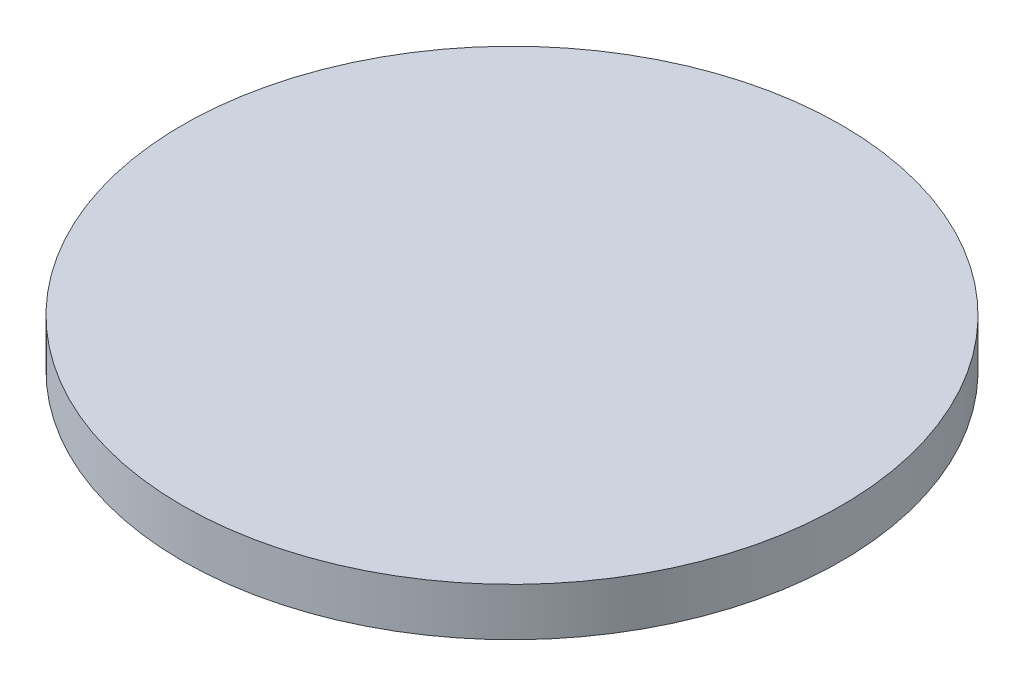
ISO-10303-21;
HEADER;
FILE_DESCRIPTION(('STEP AP214'),'2;1');
FILE_NAME('part.step','',(''),(''),'','','');
FILE_SCHEMA(('AUTOMOTIVE_DESIGN { 1 0 10303 214 1 1 1 1 }'));
ENDSEC;
DATA;
#1=APPLICATION_CONTEXT('core data for automotive mechanical design processes');
#2=APPLICATION_PROTOCOL_DEFINITION('international standard','automotive_design',2000,#1);
#3=PRODUCT_CONTEXT('',#1,'mechanical');
#4=PRODUCT('Part','Part','',(#3));
#5=PRODUCT_RELATED_PRODUCT_CATEGORY('part','',(#4));
#6=PRODUCT_DEFINITION_FORMATION('','',#4);
#7=PRODUCT_DEFINITION_CONTEXT('part definition',#1,'design');
#8=PRODUCT_DEFINITION('design','',#6,#7);
#9=PRODUCT_DEFINITION_SHAPE('','',#8);
#10=(LENGTH_UNIT() NAMED_UNIT(*) SI_UNIT(.MILLI.,.METRE.));
#11=(NAMED_UNIT(*) PLANE_ANGLE_UNIT() SI_UNIT($,.RADIAN.));
#12=(NAMED_UNIT(*) SI_UNIT($,.STERADIAN.) SOLID_ANGLE_UNIT());
#13=UNCERTAINTY_MEASURE_WITH_UNIT(LENGTH_MEASURE(1.E-05),#10,'distance_accuracy_value','');
#14=(GEOMETRIC_REPRESENTATION_CONTEXT(3) GLOBAL_UNCERTAINTY_ASSIGNED_CONTEXT((#13)) GLOBAL_UNIT_ASSIGNED_CONTEXT((#10,
#11,#12)) REPRESENTATION_CONTEXT('',''));
#15=CARTESIAN_POINT('',(0.,0.,0.));
#16=DIRECTION('',(0.,0.,1.));
#17=DIRECTION('',(1.,0.,0.));
#18=AXIS2_PLACEMENT_3D('',#15,#16,#17);
#19=CARTESIAN_POINT('',(91.816549826853,11.938326303827,48.1630816592987));
#20=DIRECTION('',(0.,1.,0.));
#21=DIRECTION('',(0.,0.,1.));
#22=AXIS2_PLACEMENT_3D('',#19,#20,#21);
#23=CYLINDRICAL_SURFACE('',#22,17.4500000000006);
#24=CARTESIAN_POINT('',(91.816549826853,11.938326303827,48.1630816592987));
#25=DIRECTION('',(0.,-1.,0.));
#26=DIRECTION('',(0.,0.,-1.));
#27=AXIS2_PLACEMENT_3D('',#24,#25,#26);
#28=CIRCLE('',#27,17.4500000000006);
#29=CARTESIAN_POINT('',(91.816549826853,11.9383263038271,30.7130816592981));
#30=VERTEX_POINT('',#29);
#31=EDGE_CURVE('E10',#30,#30,#28,.T.);
#32=ORIENTED_EDGE('',*,*,#31,.F.);
#33=EDGE_LOOP('',(#32));
#34=FACE_BOUND('',#33,.T.);
#35=CARTESIAN_POINT('',(91.816549826853,14.478326303827,48.1630816592987));
#36=DIRECTION('',(0.,-1.,0.));
#37=DIRECTION('',(0.,0.,-1.));
#38=AXIS2_PLACEMENT_3D('',#35,#36,#37);
#39=CIRCLE('',#38,17.4500000000006);
#40=CARTESIAN_POINT('',(91.816549826853,14.4783263038271,30.7130816592981));
#41=VERTEX_POINT('',#40);
#42=EDGE_CURVE('E34',#41,#41,#39,.T.);
#43=ORIENTED_EDGE('',*,*,#42,.T.);
#44=EDGE_LOOP('',(#43));
#45=FACE_BOUND('',#44,.T.);
#46=ADVANCED_FACE('F31',(#34,#45),#23,.T.);
#47=CARTESIAN_POINT('',(91.816549826853,11.938326303827,48.1630816592987));
#48=DIRECTION('',(0.,-1.,0.));
#49=DIRECTION('',(0.,0.,-1.));
#50=AXIS2_PLACEMENT_3D('',#47,#48,#49);
#51=PLANE('',#50);
#52=ORIENTED_EDGE('',*,*,#31,.T.);
#53=EDGE_LOOP('',(#52));
#54=FACE_BOUND('',#53,.T.);
#55=ADVANCED_FACE('F46',(#54),#51,.T.);
#56=CARTESIAN_POINT('',(91.816549826853,14.478326303827,48.1630816592987));
#57=DIRECTION('',(0.,-1.,0.));
#58=DIRECTION('',(0.,0.,-1.));
#59=AXIS2_PLACEMENT_3D('',#56,#57,#58);
#60=PLANE('',#59);
#61=ORIENTED_EDGE('',*,*,#42,.F.);
#62=EDGE_LOOP('',(#61));
#63=FACE_BOUND('',#62,.T.);
#64=ADVANCED_FACE('F44',(#63),#60,.F.);
#65=CLOSED_SHELL('',(#46,#55,#64));
#66=MANIFOLD_SOLID_BREP('B2',#65);
#67=ADVANCED_BREP_SHAPE_REPRESENTATION('',(#18,#66),#14);
#68=SHAPE_DEFINITION_REPRESENTATION(#9,#67);
ENDSEC;
END-ISO-10303-21;
